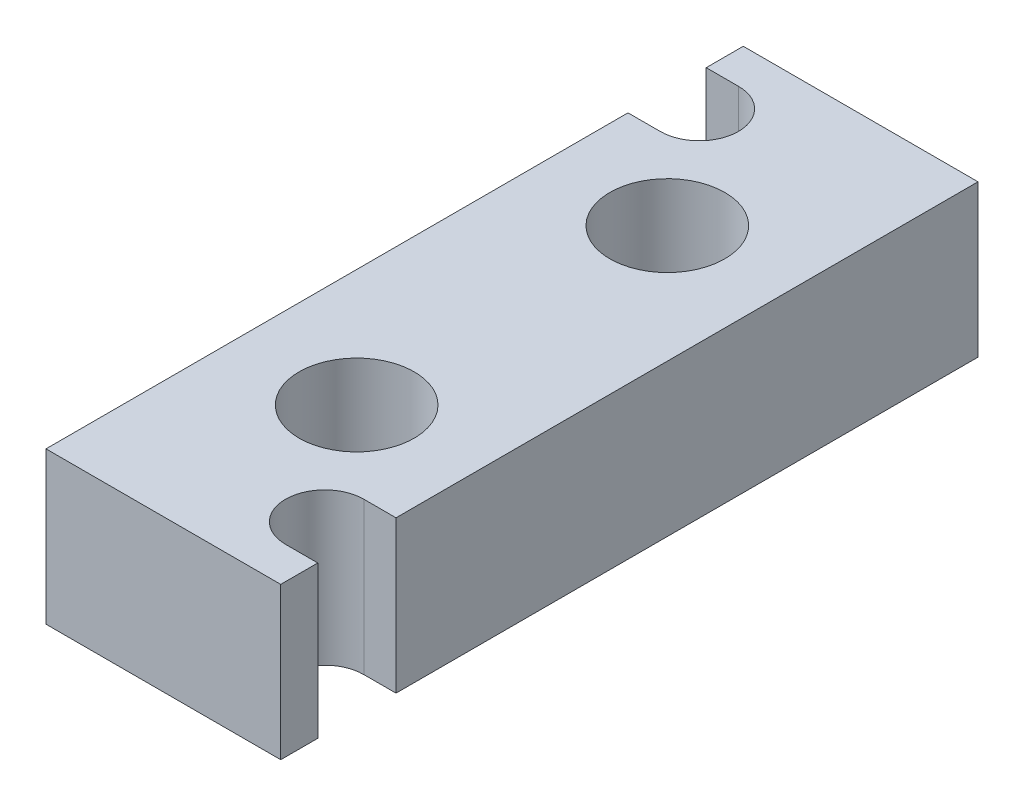
ISO-10303-21;
HEADER;
FILE_DESCRIPTION(('STEP AP214'),'2;1');
FILE_NAME('part.step','',(''),(''),'','','');
FILE_SCHEMA(('AUTOMOTIVE_DESIGN { 1 0 10303 214 1 1 1 1 }'));
ENDSEC;
DATA;
#1=APPLICATION_CONTEXT('core data for automotive mechanical design processes');
#2=APPLICATION_PROTOCOL_DEFINITION('international standard','automotive_design',2000,#1);
#3=PRODUCT_CONTEXT('',#1,'mechanical');
#4=PRODUCT('Part','Part','',(#3));
#5=PRODUCT_RELATED_PRODUCT_CATEGORY('part','',(#4));
#6=PRODUCT_DEFINITION_FORMATION('','',#4);
#7=PRODUCT_DEFINITION_CONTEXT('part definition',#1,'design');
#8=PRODUCT_DEFINITION('design','',#6,#7);
#9=PRODUCT_DEFINITION_SHAPE('','',#8);
#10=(LENGTH_UNIT() NAMED_UNIT(*) SI_UNIT(.MILLI.,.METRE.));
#11=(NAMED_UNIT(*) PLANE_ANGLE_UNIT() SI_UNIT($,.RADIAN.));
#12=(NAMED_UNIT(*) SI_UNIT($,.STERADIAN.) SOLID_ANGLE_UNIT());
#13=UNCERTAINTY_MEASURE_WITH_UNIT(LENGTH_MEASURE(1.E-05),#10,'distance_accuracy_value','');
#14=(GEOMETRIC_REPRESENTATION_CONTEXT(3) GLOBAL_UNCERTAINTY_ASSIGNED_CONTEXT((#13)) GLOBAL_UNIT_ASSIGNED_CONTEXT((#10,
#11,#12)) REPRESENTATION_CONTEXT('',''));
#15=CARTESIAN_POINT('',(0.,0.,0.));
#16=DIRECTION('',(0.,0.,1.));
#17=DIRECTION('',(1.,0.,0.));
#18=AXIS2_PLACEMENT_3D('',#15,#16,#17);
#19=CARTESIAN_POINT('',(-5.1,6.6,0.));
#20=DIRECTION('',(0.,1.,0.));
#21=DIRECTION('',(0.,0.,1.));
#22=AXIS2_PLACEMENT_3D('',#19,#20,#21);
#23=PLANE('',#22);
#24=CARTESIAN_POINT('',(0.,6.6,-6.75));
#25=DIRECTION('',(0.,1.,0.));
#26=DIRECTION('',(0.,0.,-1.));
#27=AXIS2_PLACEMENT_3D('',#24,#25,#26);
#28=CIRCLE('',#27,2.5);
#29=CARTESIAN_POINT('',(0.,6.6,-9.25));
#30=VERTEX_POINT('',#29);
#31=EDGE_CURVE('E142',#30,#30,#28,.T.);
#32=ORIENTED_EDGE('',*,*,#31,.F.);
#33=EDGE_LOOP('',(#32));
#34=FACE_BOUND('',#33,.T.);
#35=CARTESIAN_POINT('',(0.,6.6,6.75));
#36=DIRECTION('',(0.,1.,0.));
#37=DIRECTION('',(0.,0.,1.));
#38=AXIS2_PLACEMENT_3D('',#35,#36,#37);
#39=CIRCLE('',#38,2.5);
#40=CARTESIAN_POINT('',(0.,6.6,9.25));
#41=VERTEX_POINT('',#40);
#42=EDGE_CURVE('E170',#41,#41,#39,.T.);
#43=ORIENTED_EDGE('',*,*,#42,.F.);
#44=EDGE_LOOP('',(#43));
#45=FACE_BOUND('',#44,.T.);
#46=DIRECTION('',(0.,0.,1.));
#47=VECTOR('',#46,1.);
#48=CARTESIAN_POINT('',(-5.1,6.6,0.));
#49=LINE('',#48,#47);
#50=CARTESIAN_POINT('',(-5.1,6.6,-15.15));
#51=VERTEX_POINT('',#50);
#52=CARTESIAN_POINT('',(-5.10000000000009,6.6,-13.54));
#53=VERTEX_POINT('',#52);
#54=EDGE_CURVE('E195',#51,#53,#49,.T.);
#55=ORIENTED_EDGE('',*,*,#54,.T.);
#56=DIRECTION('',(-1.,0.,0.));
#57=VECTOR('',#56,1.);
#58=CARTESIAN_POINT('',(-3.70000000000009,6.6,-13.54));
#59=LINE('',#58,#57);
#60=CARTESIAN_POINT('',(-3.70000000000009,6.6,-13.54));
#61=VERTEX_POINT('',#60);
#62=EDGE_CURVE('E131',#61,#53,#59,.T.);
#63=ORIENTED_EDGE('',*,*,#62,.F.);
#64=CARTESIAN_POINT('',(-3.70000000000008,6.6,-11.84));
#65=DIRECTION('',(0.,1.,0.));
#66=DIRECTION('',(0.,0.,-1.));
#67=AXIS2_PLACEMENT_3D('',#64,#65,#66);
#68=CIRCLE('',#67,1.7);
#69=CARTESIAN_POINT('',(-3.70000000000007,6.6,-10.14));
#70=VERTEX_POINT('',#69);
#71=EDGE_CURVE('E122',#70,#61,#68,.T.);
#72=ORIENTED_EDGE('',*,*,#71,.F.);
#73=DIRECTION('',(1.,0.,0.));
#74=VECTOR('',#73,1.);
#75=CARTESIAN_POINT('',(-3.70000000000007,6.6,-10.14));
#76=LINE('',#75,#74);
#77=CARTESIAN_POINT('',(-5.10000000000007,6.6,-10.14));
#78=VERTEX_POINT('',#77);
#79=EDGE_CURVE('E133',#78,#70,#76,.T.);
#80=ORIENTED_EDGE('',*,*,#79,.F.);
#81=CARTESIAN_POINT('',(-5.1,6.6,15.15));
#82=VERTEX_POINT('',#81);
#83=EDGE_CURVE('E194',#78,#82,#49,.T.);
#84=ORIENTED_EDGE('',*,*,#83,.T.);
#85=DIRECTION('',(1.,0.,0.));
#86=VECTOR('',#85,1.);
#87=CARTESIAN_POINT('',(-5.1,6.6,15.15));
#88=LINE('',#87,#86);
#89=CARTESIAN_POINT('',(5.1,6.6,15.15));
#90=VERTEX_POINT('',#89);
#91=EDGE_CURVE('E198',#82,#90,#88,.T.);
#92=ORIENTED_EDGE('',*,*,#91,.T.);
#93=DIRECTION('',(0.,0.,-1.));
#94=VECTOR('',#93,1.);
#95=CARTESIAN_POINT('',(5.1,6.6,0.));
#96=LINE('',#95,#94);
#97=CARTESIAN_POINT('',(5.1,6.6,13.54));
#98=VERTEX_POINT('',#97);
#99=EDGE_CURVE('E201',#90,#98,#96,.T.);
#100=ORIENTED_EDGE('',*,*,#99,.T.);
#101=DIRECTION('',(1.,0.,0.));
#102=VECTOR('',#101,1.);
#103=CARTESIAN_POINT('',(3.7,6.6,13.54));
#104=LINE('',#103,#102);
#105=CARTESIAN_POINT('',(3.7,6.6,13.54));
#106=VERTEX_POINT('',#105);
#107=EDGE_CURVE('E154',#106,#98,#104,.T.);
#108=ORIENTED_EDGE('',*,*,#107,.F.);
#109=CARTESIAN_POINT('',(3.7,6.6,11.84));
#110=DIRECTION('',(0.,1.,0.));
#111=DIRECTION('',(0.,0.,1.));
#112=AXIS2_PLACEMENT_3D('',#109,#110,#111);
#113=CIRCLE('',#112,1.7);
#114=CARTESIAN_POINT('',(3.7,6.6,10.14));
#115=VERTEX_POINT('',#114);
#116=EDGE_CURVE('E152',#115,#106,#113,.T.);
#117=ORIENTED_EDGE('',*,*,#116,.F.);
#118=DIRECTION('',(-1.,0.,0.));
#119=VECTOR('',#118,1.);
#120=CARTESIAN_POINT('',(3.7,6.6,10.14));
#121=LINE('',#120,#119);
#122=CARTESIAN_POINT('',(5.1,6.6,10.14));
#123=VERTEX_POINT('',#122);
#124=EDGE_CURVE('E156',#123,#115,#121,.T.);
#125=ORIENTED_EDGE('',*,*,#124,.F.);
#126=CARTESIAN_POINT('',(5.1,6.6,-15.15));
#127=VERTEX_POINT('',#126);
#128=EDGE_CURVE('E200',#123,#127,#96,.T.);
#129=ORIENTED_EDGE('',*,*,#128,.T.);
#130=DIRECTION('',(1.,0.,0.));
#131=VECTOR('',#130,1.);
#132=CARTESIAN_POINT('',(-5.1,6.6,-15.15));
#133=LINE('',#132,#131);
#134=EDGE_CURVE('E176',#51,#127,#133,.T.);
#135=ORIENTED_EDGE('',*,*,#134,.F.);
#136=EDGE_LOOP('',(#55,#63,#72,#80,#84,#92,#100,#108,#117,#125,#129,#135));
#137=FACE_BOUND('',#136,.T.);
#138=ADVANCED_FACE('F16',(#34,#45,#137),#23,.T.);
#139=CARTESIAN_POINT('',(-5.1,0.,0.));
#140=DIRECTION('',(0.,1.,0.));
#141=DIRECTION('',(0.,0.,1.));
#142=AXIS2_PLACEMENT_3D('',#139,#140,#141);
#143=PLANE('',#142);
#144=CARTESIAN_POINT('',(0.,0.,-6.75));
#145=DIRECTION('',(0.,1.,0.));
#146=DIRECTION('',(0.,0.,-1.));
#147=AXIS2_PLACEMENT_3D('',#144,#145,#146);
#148=CIRCLE('',#147,2.5);
#149=CARTESIAN_POINT('',(0.,0.,-9.25));
#150=VERTEX_POINT('',#149);
#151=EDGE_CURVE('E123',#150,#150,#148,.T.);
#152=ORIENTED_EDGE('',*,*,#151,.T.);
#153=EDGE_LOOP('',(#152));
#154=FACE_BOUND('',#153,.T.);
#155=CARTESIAN_POINT('',(0.,0.,6.75));
#156=DIRECTION('',(0.,1.,0.));
#157=DIRECTION('',(0.,0.,1.));
#158=AXIS2_PLACEMENT_3D('',#155,#156,#157);
#159=CIRCLE('',#158,2.5);
#160=CARTESIAN_POINT('',(0.,0.,9.25));
#161=VERTEX_POINT('',#160);
#162=EDGE_CURVE('E167',#161,#161,#159,.T.);
#163=ORIENTED_EDGE('',*,*,#162,.T.);
#164=EDGE_LOOP('',(#163));
#165=FACE_BOUND('',#164,.T.);
#166=DIRECTION('',(-1.,0.,0.));
#167=VECTOR('',#166,1.);
#168=CARTESIAN_POINT('',(-3.70000000000009,0.,-13.54));
#169=LINE('',#168,#167);
#170=CARTESIAN_POINT('',(-3.70000000000009,0.,-13.54));
#171=VERTEX_POINT('',#170);
#172=CARTESIAN_POINT('',(-5.10000000000009,0.,-13.54));
#173=VERTEX_POINT('',#172);
#174=EDGE_CURVE('E105',#171,#173,#169,.T.);
#175=ORIENTED_EDGE('',*,*,#174,.T.);
#176=DIRECTION('',(0.,0.,1.));
#177=VECTOR('',#176,1.);
#178=CARTESIAN_POINT('',(-5.1,0.,0.));
#179=LINE('',#178,#177);
#180=CARTESIAN_POINT('',(-5.1,0.,-15.15));
#181=VERTEX_POINT('',#180);
#182=EDGE_CURVE('E186',#181,#173,#179,.T.);
#183=ORIENTED_EDGE('',*,*,#182,.F.);
#184=DIRECTION('',(1.,0.,0.));
#185=VECTOR('',#184,1.);
#186=CARTESIAN_POINT('',(-5.1,0.,-15.15));
#187=LINE('',#186,#185);
#188=CARTESIAN_POINT('',(5.1,0.,-15.15));
#189=VERTEX_POINT('',#188);
#190=EDGE_CURVE('E173',#181,#189,#187,.T.);
#191=ORIENTED_EDGE('',*,*,#190,.T.);
#192=DIRECTION('',(0.,0.,-1.));
#193=VECTOR('',#192,1.);
#194=CARTESIAN_POINT('',(5.1,0.,0.));
#195=LINE('',#194,#193);
#196=CARTESIAN_POINT('',(5.1,0.,10.14));
#197=VERTEX_POINT('',#196);
#198=EDGE_CURVE('E190',#197,#189,#195,.T.);
#199=ORIENTED_EDGE('',*,*,#198,.F.);
#200=DIRECTION('',(-1.,0.,0.));
#201=VECTOR('',#200,1.);
#202=CARTESIAN_POINT('',(3.7,0.,10.14));
#203=LINE('',#202,#201);
#204=CARTESIAN_POINT('',(3.7,0.,10.14));
#205=VERTEX_POINT('',#204);
#206=EDGE_CURVE('E39',#197,#205,#203,.T.);
#207=ORIENTED_EDGE('',*,*,#206,.T.);
#208=CARTESIAN_POINT('',(3.7,0.,11.84));
#209=DIRECTION('',(0.,1.,0.));
#210=DIRECTION('',(0.,0.,1.));
#211=AXIS2_PLACEMENT_3D('',#208,#209,#210);
#212=CIRCLE('',#211,1.7);
#213=CARTESIAN_POINT('',(3.7,0.,13.54));
#214=VERTEX_POINT('',#213);
#215=EDGE_CURVE('E145',#205,#214,#212,.T.);
#216=ORIENTED_EDGE('',*,*,#215,.T.);
#217=DIRECTION('',(1.,0.,0.));
#218=VECTOR('',#217,1.);
#219=CARTESIAN_POINT('',(3.7,0.,13.54));
#220=LINE('',#219,#218);
#221=CARTESIAN_POINT('',(5.1,0.,13.54));
#222=VERTEX_POINT('',#221);
#223=EDGE_CURVE('E148',#214,#222,#220,.T.);
#224=ORIENTED_EDGE('',*,*,#223,.T.);
#225=CARTESIAN_POINT('',(5.1,0.,15.15));
#226=VERTEX_POINT('',#225);
#227=EDGE_CURVE('E191',#226,#222,#195,.T.);
#228=ORIENTED_EDGE('',*,*,#227,.F.);
#229=DIRECTION('',(1.,0.,0.));
#230=VECTOR('',#229,1.);
#231=CARTESIAN_POINT('',(-5.1,0.,15.15));
#232=LINE('',#231,#230);
#233=CARTESIAN_POINT('',(-5.1,0.,15.15));
#234=VERTEX_POINT('',#233);
#235=EDGE_CURVE('E188',#234,#226,#232,.T.);
#236=ORIENTED_EDGE('',*,*,#235,.F.);
#237=CARTESIAN_POINT('',(-5.1,0.,-10.14));
#238=VERTEX_POINT('',#237);
#239=EDGE_CURVE('E185',#238,#234,#179,.T.);
#240=ORIENTED_EDGE('',*,*,#239,.F.);
#241=DIRECTION('',(1.,0.,0.));
#242=VECTOR('',#241,1.);
#243=CARTESIAN_POINT('',(-3.70000000000007,0.,-10.14));
#244=LINE('',#243,#242);
#245=CARTESIAN_POINT('',(-3.70000000000007,0.,-10.14));
#246=VERTEX_POINT('',#245);
#247=EDGE_CURVE('E31',#238,#246,#244,.T.);
#248=ORIENTED_EDGE('',*,*,#247,.T.);
#249=CARTESIAN_POINT('',(-3.70000000000008,0.,-11.84));
#250=DIRECTION('',(0.,1.,0.));
#251=DIRECTION('',(0.,0.,-1.));
#252=AXIS2_PLACEMENT_3D('',#249,#250,#251);
#253=CIRCLE('',#252,1.7);
#254=EDGE_CURVE('E115',#246,#171,#253,.T.);
#255=ORIENTED_EDGE('',*,*,#254,.T.);
#256=EDGE_LOOP('',(#175,#183,#191,#199,#207,#216,#224,#228,#236,#240,#248,#255));
#257=FACE_BOUND('',#256,.T.);
#258=ADVANCED_FACE('F125',(#154,#165,#257),#143,.F.);
#259=CARTESIAN_POINT('',(-5.1,6.6,0.));
#260=DIRECTION('',(1.,0.,0.));
#261=DIRECTION('',(0.,0.,-1.));
#262=AXIS2_PLACEMENT_3D('',#259,#260,#261);
#263=PLANE('',#262);
#264=DIRECTION('',(0.,-1.,0.));
#265=VECTOR('',#264,1.);
#266=CARTESIAN_POINT('',(-5.10000000000009,6.6,-13.54));
#267=LINE('',#266,#265);
#268=EDGE_CURVE('E111',#53,#173,#267,.T.);
#269=ORIENTED_EDGE('',*,*,#268,.F.);
#270=ORIENTED_EDGE('',*,*,#54,.F.);
#271=DIRECTION('',(0.,-1.,0.));
#272=VECTOR('',#271,1.);
#273=CARTESIAN_POINT('',(-5.1,6.6,-15.15));
#274=LINE('',#273,#272);
#275=EDGE_CURVE('E182',#51,#181,#274,.T.);
#276=ORIENTED_EDGE('',*,*,#275,.T.);
#277=ORIENTED_EDGE('',*,*,#182,.T.);
#278=EDGE_LOOP('',(#269,#270,#276,#277));
#279=FACE_BOUND('',#278,.T.);
#280=ADVANCED_FACE('F18',(#279),#263,.F.);
#281=DIRECTION('',(0.,-1.,0.));
#282=VECTOR('',#281,1.);
#283=CARTESIAN_POINT('',(-5.10000000000007,6.6,-10.14));
#284=LINE('',#283,#282);
#285=EDGE_CURVE('E137',#78,#238,#284,.T.);
#286=ORIENTED_EDGE('',*,*,#285,.T.);
#287=ORIENTED_EDGE('',*,*,#239,.T.);
#288=DIRECTION('',(0.,-1.,0.));
#289=VECTOR('',#288,1.);
#290=CARTESIAN_POINT('',(-5.1,6.6,15.15));
#291=LINE('',#290,#289);
#292=EDGE_CURVE('E11',#82,#234,#291,.T.);
#293=ORIENTED_EDGE('',*,*,#292,.F.);
#294=ORIENTED_EDGE('',*,*,#83,.F.);
#295=EDGE_LOOP('',(#286,#287,#293,#294));
#296=FACE_BOUND('',#295,.T.);
#297=ADVANCED_FACE('F230',(#296),#263,.F.);
#298=CARTESIAN_POINT('',(5.1,6.6,0.));
#299=DIRECTION('',(-1.,0.,0.));
#300=DIRECTION('',(0.,0.,1.));
#301=AXIS2_PLACEMENT_3D('',#298,#299,#300);
#302=PLANE('',#301);
#303=DIRECTION('',(0.,-1.,0.));
#304=VECTOR('',#303,1.);
#305=CARTESIAN_POINT('',(5.1,6.6,13.54));
#306=LINE('',#305,#304);
#307=EDGE_CURVE('E162',#98,#222,#306,.T.);
#308=ORIENTED_EDGE('',*,*,#307,.F.);
#309=ORIENTED_EDGE('',*,*,#99,.F.);
#310=DIRECTION('',(0.,-1.,0.));
#311=VECTOR('',#310,1.);
#312=CARTESIAN_POINT('',(5.1,6.6,15.15));
#313=LINE('',#312,#311);
#314=EDGE_CURVE('E24',#90,#226,#313,.T.);
#315=ORIENTED_EDGE('',*,*,#314,.T.);
#316=ORIENTED_EDGE('',*,*,#227,.T.);
#317=EDGE_LOOP('',(#308,#309,#315,#316));
#318=FACE_BOUND('',#317,.T.);
#319=ADVANCED_FACE('F209',(#318),#302,.F.);
#320=DIRECTION('',(0.,-1.,0.));
#321=VECTOR('',#320,1.);
#322=CARTESIAN_POINT('',(5.1,6.6,10.14));
#323=LINE('',#322,#321);
#324=EDGE_CURVE('E160',#123,#197,#323,.T.);
#325=ORIENTED_EDGE('',*,*,#324,.T.);
#326=ORIENTED_EDGE('',*,*,#198,.T.);
#327=DIRECTION('',(0.,-1.,0.));
#328=VECTOR('',#327,1.);
#329=CARTESIAN_POINT('',(5.1,6.6,-15.15));
#330=LINE('',#329,#328);
#331=EDGE_CURVE('E179',#127,#189,#330,.T.);
#332=ORIENTED_EDGE('',*,*,#331,.F.);
#333=ORIENTED_EDGE('',*,*,#128,.F.);
#334=EDGE_LOOP('',(#325,#326,#332,#333));
#335=FACE_BOUND('',#334,.T.);
#336=ADVANCED_FACE('F241',(#335),#302,.F.);
#337=CARTESIAN_POINT('',(-5.1,6.6,15.15));
#338=DIRECTION('',(0.,0.,-1.));
#339=DIRECTION('',(-1.,0.,0.));
#340=AXIS2_PLACEMENT_3D('',#337,#338,#339);
#341=PLANE('',#340);
#342=ORIENTED_EDGE('',*,*,#235,.T.);
#343=ORIENTED_EDGE('',*,*,#314,.F.);
#344=ORIENTED_EDGE('',*,*,#91,.F.);
#345=ORIENTED_EDGE('',*,*,#292,.T.);
#346=EDGE_LOOP('',(#342,#343,#344,#345));
#347=FACE_BOUND('',#346,.T.);
#348=ADVANCED_FACE('F228',(#347),#341,.F.);
#349=CARTESIAN_POINT('',(-5.1,6.6,-15.15));
#350=DIRECTION('',(0.,0.,1.));
#351=DIRECTION('',(-1.,0.,0.));
#352=AXIS2_PLACEMENT_3D('',#349,#350,#351);
#353=PLANE('',#352);
#354=ORIENTED_EDGE('',*,*,#190,.F.);
#355=ORIENTED_EDGE('',*,*,#275,.F.);
#356=ORIENTED_EDGE('',*,*,#134,.T.);
#357=ORIENTED_EDGE('',*,*,#331,.T.);
#358=EDGE_LOOP('',(#354,#355,#356,#357));
#359=FACE_BOUND('',#358,.T.);
#360=ADVANCED_FACE('F238',(#359),#353,.F.);
#361=CARTESIAN_POINT('',(0.,6.6,6.75));
#362=DIRECTION('',(0.,-1.,0.));
#363=DIRECTION('',(0.,0.,-1.));
#364=AXIS2_PLACEMENT_3D('',#361,#362,#363);
#365=CYLINDRICAL_SURFACE('',#364,2.5);
#366=ORIENTED_EDGE('',*,*,#42,.T.);
#367=EDGE_LOOP('',(#366));
#368=FACE_BOUND('',#367,.T.);
#369=ORIENTED_EDGE('',*,*,#162,.F.);
#370=EDGE_LOOP('',(#369));
#371=FACE_BOUND('',#370,.T.);
#372=ADVANCED_FACE('F272',(#368,#371),#365,.F.);
#373=CARTESIAN_POINT('',(3.7,6.6,11.84));
#374=DIRECTION('',(0.,-1.,0.));
#375=DIRECTION('',(0.,0.,-1.));
#376=AXIS2_PLACEMENT_3D('',#373,#374,#375);
#377=CYLINDRICAL_SURFACE('',#376,1.7);
#378=ORIENTED_EDGE('',*,*,#215,.F.);
#379=DIRECTION('',(0.,-1.,0.));
#380=VECTOR('',#379,1.);
#381=CARTESIAN_POINT('',(3.7,6.6,10.14));
#382=LINE('',#381,#380);
#383=EDGE_CURVE('E158',#115,#205,#382,.T.);
#384=ORIENTED_EDGE('',*,*,#383,.F.);
#385=ORIENTED_EDGE('',*,*,#116,.T.);
#386=DIRECTION('',(0.,-1.,0.));
#387=VECTOR('',#386,1.);
#388=CARTESIAN_POINT('',(3.7,6.6,13.54));
#389=LINE('',#388,#387);
#390=EDGE_CURVE('E164',#106,#214,#389,.T.);
#391=ORIENTED_EDGE('',*,*,#390,.T.);
#392=EDGE_LOOP('',(#378,#384,#385,#391));
#393=FACE_BOUND('',#392,.T.);
#394=ADVANCED_FACE('F219',(#393),#377,.F.);
#395=CARTESIAN_POINT('',(3.7,6.6,13.54));
#396=DIRECTION('',(0.,0.,-1.));
#397=DIRECTION('',(-1.,0.,0.));
#398=AXIS2_PLACEMENT_3D('',#395,#396,#397);
#399=PLANE('',#398);
#400=ORIENTED_EDGE('',*,*,#223,.F.);
#401=ORIENTED_EDGE('',*,*,#390,.F.);
#402=ORIENTED_EDGE('',*,*,#107,.T.);
#403=ORIENTED_EDGE('',*,*,#307,.T.);
#404=EDGE_LOOP('',(#400,#401,#402,#403));
#405=FACE_BOUND('',#404,.T.);
#406=ADVANCED_FACE('F216',(#405),#399,.T.);
#407=CARTESIAN_POINT('',(3.7,6.6,10.14));
#408=DIRECTION('',(0.,0.,1.));
#409=DIRECTION('',(1.,0.,0.));
#410=AXIS2_PLACEMENT_3D('',#407,#408,#409);
#411=PLANE('',#410);
#412=ORIENTED_EDGE('',*,*,#206,.F.);
#413=ORIENTED_EDGE('',*,*,#324,.F.);
#414=ORIENTED_EDGE('',*,*,#124,.T.);
#415=ORIENTED_EDGE('',*,*,#383,.T.);
#416=EDGE_LOOP('',(#412,#413,#414,#415));
#417=FACE_BOUND('',#416,.T.);
#418=ADVANCED_FACE('F242',(#417),#411,.T.);
#419=CARTESIAN_POINT('',(0.,6.6,-6.75));
#420=DIRECTION('',(0.,-1.,0.));
#421=DIRECTION('',(0.,0.,-1.));
#422=AXIS2_PLACEMENT_3D('',#419,#420,#421);
#423=CYLINDRICAL_SURFACE('',#422,2.5);
#424=ORIENTED_EDGE('',*,*,#31,.T.);
#425=EDGE_LOOP('',(#424));
#426=FACE_BOUND('',#425,.T.);
#427=ORIENTED_EDGE('',*,*,#151,.F.);
#428=EDGE_LOOP('',(#427));
#429=FACE_BOUND('',#428,.T.);
#430=ADVANCED_FACE('F244',(#426,#429),#423,.F.);
#431=CARTESIAN_POINT('',(-3.70000000000008,6.6,-11.84));
#432=DIRECTION('',(0.,-1.,0.));
#433=DIRECTION('',(0.,0.,-1.));
#434=AXIS2_PLACEMENT_3D('',#431,#432,#433);
#435=CYLINDRICAL_SURFACE('',#434,1.7);
#436=ORIENTED_EDGE('',*,*,#254,.F.);
#437=DIRECTION('',(0.,-1.,0.));
#438=VECTOR('',#437,1.);
#439=CARTESIAN_POINT('',(-3.70000000000007,6.6,-10.14));
#440=LINE('',#439,#438);
#441=EDGE_CURVE('E135',#70,#246,#440,.T.);
#442=ORIENTED_EDGE('',*,*,#441,.F.);
#443=ORIENTED_EDGE('',*,*,#71,.T.);
#444=DIRECTION('',(0.,-1.,0.));
#445=VECTOR('',#444,1.);
#446=CARTESIAN_POINT('',(-3.70000000000009,6.6,-13.54));
#447=LINE('',#446,#445);
#448=EDGE_CURVE('E108',#61,#171,#447,.T.);
#449=ORIENTED_EDGE('',*,*,#448,.T.);
#450=EDGE_LOOP('',(#436,#442,#443,#449));
#451=FACE_BOUND('',#450,.T.);
#452=ADVANCED_FACE('F119',(#451),#435,.F.);
#453=CARTESIAN_POINT('',(-3.70000000000009,6.6,-13.54));
#454=DIRECTION('',(0.,0.,1.));
#455=DIRECTION('',(1.,0.,0.));
#456=AXIS2_PLACEMENT_3D('',#453,#454,#455);
#457=PLANE('',#456);
#458=ORIENTED_EDGE('',*,*,#174,.F.);
#459=ORIENTED_EDGE('',*,*,#448,.F.);
#460=ORIENTED_EDGE('',*,*,#62,.T.);
#461=ORIENTED_EDGE('',*,*,#268,.T.);
#462=EDGE_LOOP('',(#458,#459,#460,#461));
#463=FACE_BOUND('',#462,.T.);
#464=ADVANCED_FACE('F107',(#463),#457,.T.);
#465=CARTESIAN_POINT('',(-3.70000000000007,6.6,-10.14));
#466=DIRECTION('',(0.,0.,-1.));
#467=DIRECTION('',(-1.,0.,0.));
#468=AXIS2_PLACEMENT_3D('',#465,#466,#467);
#469=PLANE('',#468);
#470=ORIENTED_EDGE('',*,*,#247,.F.);
#471=ORIENTED_EDGE('',*,*,#285,.F.);
#472=ORIENTED_EDGE('',*,*,#79,.T.);
#473=ORIENTED_EDGE('',*,*,#441,.T.);
#474=EDGE_LOOP('',(#470,#471,#472,#473));
#475=FACE_BOUND('',#474,.T.);
#476=ADVANCED_FACE('F231',(#475),#469,.T.);
#477=CLOSED_SHELL('',(#138,#258,#280,#297,#319,#336,#348,#360,#372,#394,#406,#418,#430,#452,
#464,#476));
#478=MANIFOLD_SOLID_BREP('B1',#477);
#479=ADVANCED_BREP_SHAPE_REPRESENTATION('',(#18,#478),#14);
#480=SHAPE_DEFINITION_REPRESENTATION(#9,#479);
ENDSEC;
END-ISO-10303-21;
